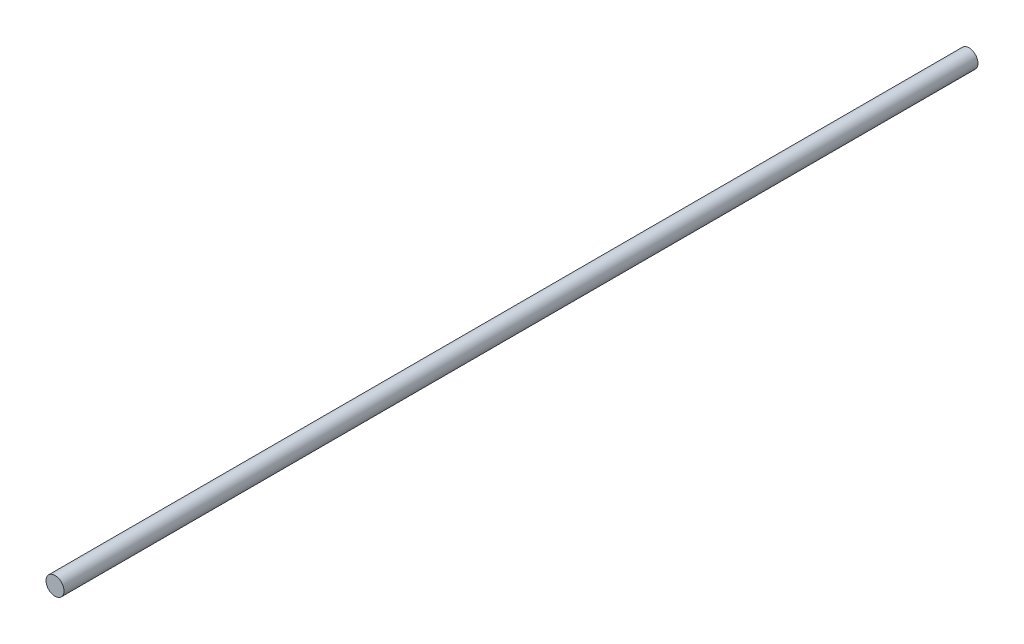
ISO-10303-21;
HEADER;
FILE_DESCRIPTION(('STEP AP214'),'2;1');
FILE_NAME('part.step','',(''),(''),'','','');
FILE_SCHEMA(('AUTOMOTIVE_DESIGN { 1 0 10303 214 1 1 1 1 }'));
ENDSEC;
DATA;
#1=APPLICATION_CONTEXT('core data for automotive mechanical design processes');
#2=APPLICATION_PROTOCOL_DEFINITION('international standard','automotive_design',2000,#1);
#3=PRODUCT_CONTEXT('',#1,'mechanical');
#4=PRODUCT('Part','Part','',(#3));
#5=PRODUCT_RELATED_PRODUCT_CATEGORY('part','',(#4));
#6=PRODUCT_DEFINITION_FORMATION('','',#4);
#7=PRODUCT_DEFINITION_CONTEXT('part definition',#1,'design');
#8=PRODUCT_DEFINITION('design','',#6,#7);
#9=PRODUCT_DEFINITION_SHAPE('','',#8);
#10=(LENGTH_UNIT() NAMED_UNIT(*) SI_UNIT(.MILLI.,.METRE.));
#11=(NAMED_UNIT(*) PLANE_ANGLE_UNIT() SI_UNIT($,.RADIAN.));
#12=(NAMED_UNIT(*) SI_UNIT($,.STERADIAN.) SOLID_ANGLE_UNIT());
#13=UNCERTAINTY_MEASURE_WITH_UNIT(LENGTH_MEASURE(1.E-05),#10,'distance_accuracy_value','');
#14=(GEOMETRIC_REPRESENTATION_CONTEXT(3) GLOBAL_UNCERTAINTY_ASSIGNED_CONTEXT((#13)) GLOBAL_UNIT_ASSIGNED_CONTEXT((#10,
#11,#12)) REPRESENTATION_CONTEXT('',''));
#15=CARTESIAN_POINT('',(0.,0.,0.));
#16=DIRECTION('',(0.,0.,1.));
#17=DIRECTION('',(1.,0.,0.));
#18=AXIS2_PLACEMENT_3D('',#15,#16,#17);
#19=CARTESIAN_POINT('',(-356.05,162.7,241.3));
#20=DIRECTION('',(0.,0.,-1.));
#21=DIRECTION('',(-1.,0.,0.));
#22=AXIS2_PLACEMENT_3D('',#19,#20,#21);
#23=CYLINDRICAL_SURFACE('',#22,4.76250000000001);
#24=CARTESIAN_POINT('',(-356.05,162.7,241.3));
#25=DIRECTION('',(0.,0.,1.));
#26=DIRECTION('',(1.,0.,0.));
#27=AXIS2_PLACEMENT_3D('',#24,#25,#26);
#28=CIRCLE('',#27,4.76250000000001);
#29=CARTESIAN_POINT('',(-351.2875,162.7,241.3));
#30=VERTEX_POINT('',#29);
#31=EDGE_CURVE('E10',#30,#30,#28,.T.);
#32=ORIENTED_EDGE('',*,*,#31,.F.);
#33=EDGE_LOOP('',(#32));
#34=FACE_BOUND('',#33,.T.);
#35=CARTESIAN_POINT('',(-356.05,162.7,-241.3));
#36=DIRECTION('',(0.,0.,1.));
#37=DIRECTION('',(1.,0.,0.));
#38=AXIS2_PLACEMENT_3D('',#35,#36,#37);
#39=CIRCLE('',#38,4.76250000000001);
#40=CARTESIAN_POINT('',(-351.2875,162.7,-241.3));
#41=VERTEX_POINT('',#40);
#42=EDGE_CURVE('E37',#41,#41,#39,.T.);
#43=ORIENTED_EDGE('',*,*,#42,.T.);
#44=EDGE_LOOP('',(#43));
#45=FACE_BOUND('',#44,.T.);
#46=ADVANCED_FACE('F34',(#34,#45),#23,.T.);
#47=CARTESIAN_POINT('',(-356.05,162.7,241.3));
#48=DIRECTION('',(0.,0.,1.));
#49=DIRECTION('',(1.,0.,0.));
#50=AXIS2_PLACEMENT_3D('',#47,#48,#49);
#51=PLANE('',#50);
#52=ORIENTED_EDGE('',*,*,#31,.T.);
#53=EDGE_LOOP('',(#52));
#54=FACE_BOUND('',#53,.T.);
#55=ADVANCED_FACE('F51',(#54),#51,.T.);
#56=CARTESIAN_POINT('',(-356.05,162.7,-241.3));
#57=DIRECTION('',(0.,0.,1.));
#58=DIRECTION('',(1.,0.,0.));
#59=AXIS2_PLACEMENT_3D('',#56,#57,#58);
#60=PLANE('',#59);
#61=ORIENTED_EDGE('',*,*,#42,.F.);
#62=EDGE_LOOP('',(#61));
#63=FACE_BOUND('',#62,.T.);
#64=ADVANCED_FACE('F49',(#63),#60,.F.);
#65=CLOSED_SHELL('',(#46,#55,#64));
#66=MANIFOLD_SOLID_BREP('B2',#65);
#67=ADVANCED_BREP_SHAPE_REPRESENTATION('',(#18,#66),#14);
#68=SHAPE_DEFINITION_REPRESENTATION(#9,#67);
ENDSEC;
END-ISO-10303-21;
